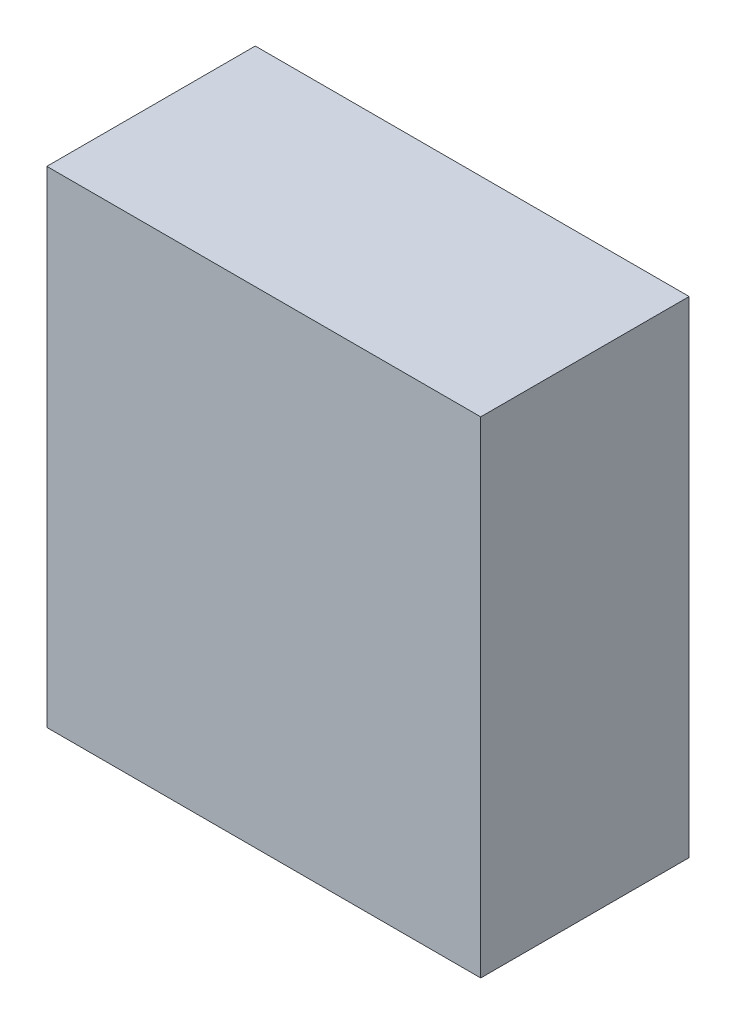
ISO-10303-21;
HEADER;
FILE_DESCRIPTION(('STEP AP214'),'2;1');
FILE_NAME('part.step','',(''),(''),'','','');
FILE_SCHEMA(('AUTOMOTIVE_DESIGN { 1 0 10303 214 1 1 1 1 }'));
ENDSEC;
DATA;
#1=APPLICATION_CONTEXT('core data for automotive mechanical design processes');
#2=APPLICATION_PROTOCOL_DEFINITION('international standard','automotive_design',2000,#1);
#3=PRODUCT_CONTEXT('',#1,'mechanical');
#4=PRODUCT('Part','Part','',(#3));
#5=PRODUCT_RELATED_PRODUCT_CATEGORY('part','',(#4));
#6=PRODUCT_DEFINITION_FORMATION('','',#4);
#7=PRODUCT_DEFINITION_CONTEXT('part definition',#1,'design');
#8=PRODUCT_DEFINITION('design','',#6,#7);
#9=PRODUCT_DEFINITION_SHAPE('','',#8);
#10=(LENGTH_UNIT() NAMED_UNIT(*) SI_UNIT(.MILLI.,.METRE.));
#11=(NAMED_UNIT(*) PLANE_ANGLE_UNIT() SI_UNIT($,.RADIAN.));
#12=(NAMED_UNIT(*) SI_UNIT($,.STERADIAN.) SOLID_ANGLE_UNIT());
#13=UNCERTAINTY_MEASURE_WITH_UNIT(LENGTH_MEASURE(1.E-05),#10,'distance_accuracy_value','');
#14=(GEOMETRIC_REPRESENTATION_CONTEXT(3) GLOBAL_UNCERTAINTY_ASSIGNED_CONTEXT((#13)) GLOBAL_UNIT_ASSIGNED_CONTEXT((#10,
#11,#12)) REPRESENTATION_CONTEXT('',''));
#15=CARTESIAN_POINT('',(0.,0.,0.));
#16=DIRECTION('',(0.,0.,1.));
#17=DIRECTION('',(1.,0.,0.));
#18=AXIS2_PLACEMENT_3D('',#15,#16,#17);
#19=CARTESIAN_POINT('',(0.,0.,0.60000134));
#20=DIRECTION('',(0.,0.,-1.));
#21=DIRECTION('',(-1.,0.,0.));
#22=AXIS2_PLACEMENT_3D('',#19,#20,#21);
#23=PLANE('',#22);
#24=DIRECTION('',(1.,0.,0.));
#25=VECTOR('',#24,1.);
#26=CARTESIAN_POINT('',(0.62449202,-0.69949314,0.60000134));
#27=LINE('',#26,#25);
#28=CARTESIAN_POINT('',(0.62449202,-0.69949314,0.60000134));
#29=VERTEX_POINT('',#28);
#30=CARTESIAN_POINT('',(-0.62449202,-0.69949314,0.60000134));
#31=VERTEX_POINT('',#30);
#32=EDGE_CURVE('E68',#29,#31,#27,.F.);
#33=ORIENTED_EDGE('',*,*,#32,.F.);
#34=DIRECTION('',(0.,1.,0.));
#35=VECTOR('',#34,1.);
#36=CARTESIAN_POINT('',(0.62449202,0.69949314,0.60000134));
#37=LINE('',#36,#35);
#38=CARTESIAN_POINT('',(0.62449202,0.69949314,0.60000134));
#39=VERTEX_POINT('',#38);
#40=EDGE_CURVE('E55',#39,#29,#37,.F.);
#41=ORIENTED_EDGE('',*,*,#40,.F.);
#42=DIRECTION('',(1.,0.,0.));
#43=VECTOR('',#42,1.);
#44=CARTESIAN_POINT('',(-0.62449202,0.69949314,0.60000134));
#45=LINE('',#44,#43);
#46=CARTESIAN_POINT('',(-0.62449202,0.69949314,0.60000134));
#47=VERTEX_POINT('',#46);
#48=EDGE_CURVE('E20',#47,#39,#45,.T.);
#49=ORIENTED_EDGE('',*,*,#48,.F.);
#50=DIRECTION('',(0.,1.,0.));
#51=VECTOR('',#50,1.);
#52=CARTESIAN_POINT('',(-0.62449202,-0.69949314,0.60000134));
#53=LINE('',#52,#51);
#54=EDGE_CURVE('E80',#31,#47,#53,.T.);
#55=ORIENTED_EDGE('',*,*,#54,.F.);
#56=EDGE_LOOP('',(#33,#41,#49,#55));
#57=FACE_BOUND('',#56,.T.);
#58=ADVANCED_FACE('F17',(#57),#23,.F.);
#59=CARTESIAN_POINT('',(-0.62449202,0.69949314,0.));
#60=DIRECTION('',(0.,1.,0.));
#61=DIRECTION('',(0.,0.,1.));
#62=AXIS2_PLACEMENT_3D('',#59,#60,#61);
#63=PLANE('',#62);
#64=DIRECTION('',(0.,0.,-1.));
#65=VECTOR('',#64,1.);
#66=CARTESIAN_POINT('',(0.62449202,0.69949314,0.));
#67=LINE('',#66,#65);
#68=CARTESIAN_POINT('',(0.62449202,0.69949314,0.));
#69=VERTEX_POINT('',#68);
#70=EDGE_CURVE('E61',#69,#39,#67,.F.);
#71=ORIENTED_EDGE('',*,*,#70,.F.);
#72=DIRECTION('',(-1.,0.,0.));
#73=VECTOR('',#72,1.);
#74=CARTESIAN_POINT('',(0.,0.69949314,0.));
#75=LINE('',#74,#73);
#76=CARTESIAN_POINT('',(-0.62449202,0.69949314,0.));
#77=VERTEX_POINT('',#76);
#78=EDGE_CURVE('E83',#77,#69,#75,.F.);
#79=ORIENTED_EDGE('',*,*,#78,.F.);
#80=DIRECTION('',(0.,0.,1.));
#81=VECTOR('',#80,1.);
#82=CARTESIAN_POINT('',(-0.62449202,0.69949314,0.));
#83=LINE('',#82,#81);
#84=EDGE_CURVE('E64',#47,#77,#83,.F.);
#85=ORIENTED_EDGE('',*,*,#84,.F.);
#86=ORIENTED_EDGE('',*,*,#48,.T.);
#87=EDGE_LOOP('',(#71,#79,#85,#86));
#88=FACE_BOUND('',#87,.T.);
#89=ADVANCED_FACE('F60',(#88),#63,.T.);
#90=CARTESIAN_POINT('',(0.62449202,0.69949314,0.));
#91=DIRECTION('',(1.,0.,0.));
#92=DIRECTION('',(0.,0.,-1.));
#93=AXIS2_PLACEMENT_3D('',#90,#91,#92);
#94=PLANE('',#93);
#95=DIRECTION('',(0.,0.,-1.));
#96=VECTOR('',#95,1.);
#97=CARTESIAN_POINT('',(0.62449202,-0.69949314,0.));
#98=LINE('',#97,#96);
#99=CARTESIAN_POINT('',(0.62449202,-0.69949314,0.));
#100=VERTEX_POINT('',#99);
#101=EDGE_CURVE('E70',#100,#29,#98,.F.);
#102=ORIENTED_EDGE('',*,*,#101,.F.);
#103=DIRECTION('',(0.,1.,0.));
#104=VECTOR('',#103,1.);
#105=CARTESIAN_POINT('',(0.62449202,0.,0.));
#106=LINE('',#105,#104);
#107=EDGE_CURVE('E74',#69,#100,#106,.F.);
#108=ORIENTED_EDGE('',*,*,#107,.F.);
#109=ORIENTED_EDGE('',*,*,#70,.T.);
#110=ORIENTED_EDGE('',*,*,#40,.T.);
#111=EDGE_LOOP('',(#102,#108,#109,#110));
#112=FACE_BOUND('',#111,.T.);
#113=ADVANCED_FACE('F72',(#112),#94,.T.);
#114=CARTESIAN_POINT('',(0.62449202,-0.69949314,0.));
#115=DIRECTION('',(0.,-1.,0.));
#116=DIRECTION('',(0.,0.,-1.));
#117=AXIS2_PLACEMENT_3D('',#114,#115,#116);
#118=PLANE('',#117);
#119=DIRECTION('',(0.,0.,1.));
#120=VECTOR('',#119,1.);
#121=CARTESIAN_POINT('',(-0.62449202,-0.69949314,0.));
#122=LINE('',#121,#120);
#123=CARTESIAN_POINT('',(-0.62449202,-0.69949314,0.));
#124=VERTEX_POINT('',#123);
#125=EDGE_CURVE('E35',#124,#31,#122,.T.);
#126=ORIENTED_EDGE('',*,*,#125,.F.);
#127=DIRECTION('',(-1.,0.,0.));
#128=VECTOR('',#127,1.);
#129=CARTESIAN_POINT('',(0.,-0.69949314,0.));
#130=LINE('',#129,#128);
#131=EDGE_CURVE('E26',#100,#124,#130,.T.);
#132=ORIENTED_EDGE('',*,*,#131,.F.);
#133=ORIENTED_EDGE('',*,*,#101,.T.);
#134=ORIENTED_EDGE('',*,*,#32,.T.);
#135=EDGE_LOOP('',(#126,#132,#133,#134));
#136=FACE_BOUND('',#135,.T.);
#137=ADVANCED_FACE('F89',(#136),#118,.T.);
#138=CARTESIAN_POINT('',(-0.62449202,-0.69949314,0.));
#139=DIRECTION('',(-1.,0.,0.));
#140=DIRECTION('',(0.,0.,1.));
#141=AXIS2_PLACEMENT_3D('',#138,#139,#140);
#142=PLANE('',#141);
#143=ORIENTED_EDGE('',*,*,#84,.T.);
#144=DIRECTION('',(0.,1.,0.));
#145=VECTOR('',#144,1.);
#146=CARTESIAN_POINT('',(-0.62449202,0.,0.));
#147=LINE('',#146,#145);
#148=EDGE_CURVE('E11',#124,#77,#147,.T.);
#149=ORIENTED_EDGE('',*,*,#148,.F.);
#150=ORIENTED_EDGE('',*,*,#125,.T.);
#151=ORIENTED_EDGE('',*,*,#54,.T.);
#152=EDGE_LOOP('',(#143,#149,#150,#151));
#153=FACE_BOUND('',#152,.T.);
#154=ADVANCED_FACE('F91',(#153),#142,.T.);
#155=CARTESIAN_POINT('',(0.,0.,0.));
#156=DIRECTION('',(0.,0.,-1.));
#157=DIRECTION('',(-1.,0.,0.));
#158=AXIS2_PLACEMENT_3D('',#155,#156,#157);
#159=PLANE('',#158);
#160=ORIENTED_EDGE('',*,*,#131,.T.);
#161=ORIENTED_EDGE('',*,*,#148,.T.);
#162=ORIENTED_EDGE('',*,*,#78,.T.);
#163=ORIENTED_EDGE('',*,*,#107,.T.);
#164=EDGE_LOOP('',(#160,#161,#162,#163));
#165=FACE_BOUND('',#164,.T.);
#166=ADVANCED_FACE('F88',(#165),#159,.T.);
#167=CLOSED_SHELL('',(#58,#89,#113,#137,#154,#166));
#168=MANIFOLD_SOLID_BREP('B1',#167);
#169=ADVANCED_BREP_SHAPE_REPRESENTATION('',(#18,#168),#14);
#170=SHAPE_DEFINITION_REPRESENTATION(#9,#169);
ENDSEC;
END-ISO-10303-21;
